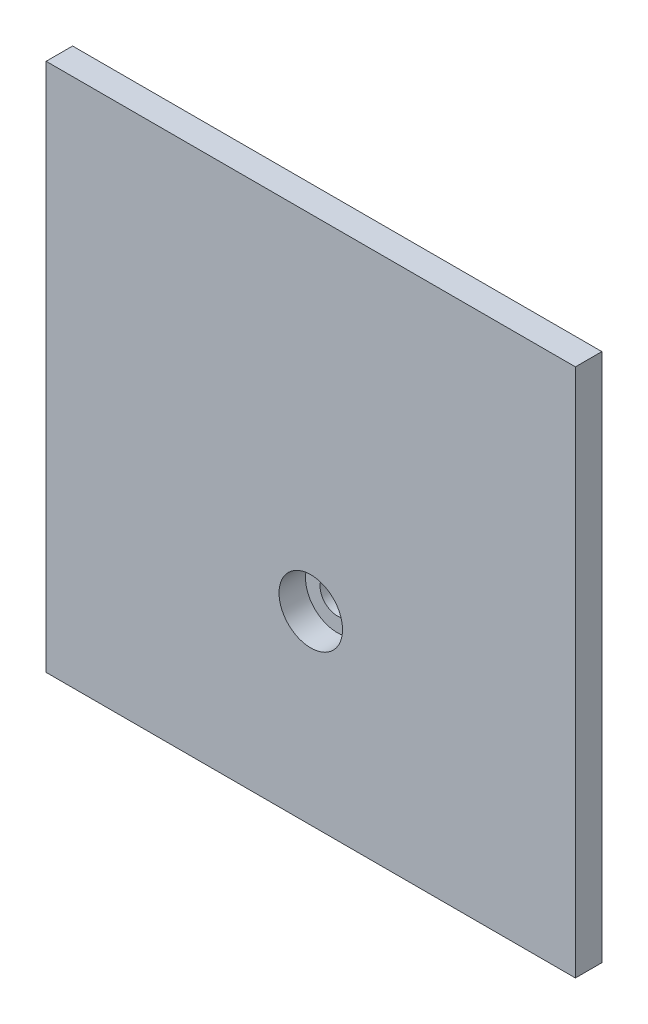
ISO-10303-21;
HEADER;
FILE_DESCRIPTION(('STEP AP214'),'2;1');
FILE_NAME('part.step','',(''),(''),'','','');
FILE_SCHEMA(('AUTOMOTIVE_DESIGN { 1 0 10303 214 1 1 1 1 }'));
ENDSEC;
DATA;
#1=APPLICATION_CONTEXT('core data for automotive mechanical design processes');
#2=APPLICATION_PROTOCOL_DEFINITION('international standard','automotive_design',2000,#1);
#3=PRODUCT_CONTEXT('',#1,'mechanical');
#4=PRODUCT('Part','Part','',(#3));
#5=PRODUCT_RELATED_PRODUCT_CATEGORY('part','',(#4));
#6=PRODUCT_DEFINITION_FORMATION('','',#4);
#7=PRODUCT_DEFINITION_CONTEXT('part definition',#1,'design');
#8=PRODUCT_DEFINITION('design','',#6,#7);
#9=PRODUCT_DEFINITION_SHAPE('','',#8);
#10=(LENGTH_UNIT() NAMED_UNIT(*) SI_UNIT(.MILLI.,.METRE.));
#11=(NAMED_UNIT(*) PLANE_ANGLE_UNIT() SI_UNIT($,.RADIAN.));
#12=(NAMED_UNIT(*) SI_UNIT($,.STERADIAN.) SOLID_ANGLE_UNIT());
#13=UNCERTAINTY_MEASURE_WITH_UNIT(LENGTH_MEASURE(1.E-05),#10,'distance_accuracy_value','');
#14=(GEOMETRIC_REPRESENTATION_CONTEXT(3) GLOBAL_UNCERTAINTY_ASSIGNED_CONTEXT((#13)) GLOBAL_UNIT_ASSIGNED_CONTEXT((#10,
#11,#12)) REPRESENTATION_CONTEXT('',''));
#15=CARTESIAN_POINT('',(0.,0.,0.));
#16=DIRECTION('',(0.,0.,1.));
#17=DIRECTION('',(1.,0.,0.));
#18=AXIS2_PLACEMENT_3D('',#15,#16,#17);
#19=CARTESIAN_POINT('',(0.,-15.,5.));
#20=DIRECTION('',(0.,0.,-1.));
#21=DIRECTION('',(-1.,0.,0.));
#22=AXIS2_PLACEMENT_3D('',#19,#20,#21);
#23=CYLINDRICAL_SURFACE('',#22,3.25);
#24=CARTESIAN_POINT('',(0.,-15.,-30.));
#25=DIRECTION('',(0.,0.,-1.));
#26=DIRECTION('',(-1.,0.,0.));
#27=AXIS2_PLACEMENT_3D('',#24,#25,#26);
#28=CIRCLE('',#27,3.25);
#29=CARTESIAN_POINT('',(-3.25,-15.,-30.));
#30=VERTEX_POINT('',#29);
#31=EDGE_CURVE('E280',#30,#30,#28,.T.);
#32=ORIENTED_EDGE('',*,*,#31,.T.);
#33=EDGE_LOOP('',(#32));
#34=FACE_BOUND('',#33,.T.);
#35=CARTESIAN_POINT('',(0.,-15.,0.));
#36=DIRECTION('',(0.,0.,1.));
#37=DIRECTION('',(1.,0.,0.));
#38=AXIS2_PLACEMENT_3D('',#35,#36,#37);
#39=CIRCLE('',#38,3.25);
#40=CARTESIAN_POINT('',(3.25,-15.,0.));
#41=VERTEX_POINT('',#40);
#42=EDGE_CURVE('E36',#41,#41,#39,.F.);
#43=ORIENTED_EDGE('',*,*,#42,.F.);
#44=EDGE_LOOP('',(#43));
#45=FACE_BOUND('',#44,.T.);
#46=ADVANCED_FACE('F32',(#34,#45),#23,.F.);
#47=CARTESIAN_POINT('',(50.,50.,5.));
#48=DIRECTION('',(-1.,0.,0.));
#49=DIRECTION('',(0.,-1.,0.));
#50=AXIS2_PLACEMENT_3D('',#47,#48,#49);
#51=PLANE('',#50);
#52=DIRECTION('',(0.,1.,0.));
#53=VECTOR('',#52,1.);
#54=CARTESIAN_POINT('',(50.,50.,0.));
#55=LINE('',#54,#53);
#56=CARTESIAN_POINT('',(50.,-50.,0.));
#57=VERTEX_POINT('',#56);
#58=CARTESIAN_POINT('',(50.,50.,0.));
#59=VERTEX_POINT('',#58);
#60=EDGE_CURVE('E126',#57,#59,#55,.T.);
#61=ORIENTED_EDGE('',*,*,#60,.T.);
#62=DIRECTION('',(0.,0.,-1.));
#63=VECTOR('',#62,1.);
#64=CARTESIAN_POINT('',(50.,50.,5.));
#65=LINE('',#64,#63);
#66=CARTESIAN_POINT('',(50.,50.,5.));
#67=VERTEX_POINT('',#66);
#68=EDGE_CURVE('E11',#67,#59,#65,.T.);
#69=ORIENTED_EDGE('',*,*,#68,.F.);
#70=DIRECTION('',(0.,1.,0.));
#71=VECTOR('',#70,1.);
#72=CARTESIAN_POINT('',(50.,50.,5.));
#73=LINE('',#72,#71);
#74=CARTESIAN_POINT('',(50.,-50.,5.));
#75=VERTEX_POINT('',#74);
#76=EDGE_CURVE('E127',#75,#67,#73,.T.);
#77=ORIENTED_EDGE('',*,*,#76,.F.);
#78=DIRECTION('',(0.,0.,-1.));
#79=VECTOR('',#78,1.);
#80=CARTESIAN_POINT('',(50.,-50.,5.));
#81=LINE('',#80,#79);
#82=EDGE_CURVE('E137',#75,#57,#81,.T.);
#83=ORIENTED_EDGE('',*,*,#82,.T.);
#84=EDGE_LOOP('',(#61,#69,#77,#83));
#85=FACE_BOUND('',#84,.T.);
#86=ADVANCED_FACE('F34',(#85),#51,.F.);
#87=CARTESIAN_POINT('',(-50.,50.,5.));
#88=DIRECTION('',(0.,-1.,0.));
#89=DIRECTION('',(0.,0.,-1.));
#90=AXIS2_PLACEMENT_3D('',#87,#88,#89);
#91=PLANE('',#90);
#92=DIRECTION('',(-1.,0.,0.));
#93=VECTOR('',#92,1.);
#94=CARTESIAN_POINT('',(-50.,50.,0.));
#95=LINE('',#94,#93);
#96=CARTESIAN_POINT('',(-50.,50.,0.));
#97=VERTEX_POINT('',#96);
#98=EDGE_CURVE('E140',#59,#97,#95,.T.);
#99=ORIENTED_EDGE('',*,*,#98,.T.);
#100=DIRECTION('',(0.,0.,-1.));
#101=VECTOR('',#100,1.);
#102=CARTESIAN_POINT('',(-50.,50.,5.));
#103=LINE('',#102,#101);
#104=CARTESIAN_POINT('',(-50.,50.,5.));
#105=VERTEX_POINT('',#104);
#106=EDGE_CURVE('E41',#105,#97,#103,.T.);
#107=ORIENTED_EDGE('',*,*,#106,.F.);
#108=DIRECTION('',(-1.,0.,0.));
#109=VECTOR('',#108,1.);
#110=CARTESIAN_POINT('',(-50.,50.,5.));
#111=LINE('',#110,#109);
#112=EDGE_CURVE('E130',#67,#105,#111,.T.);
#113=ORIENTED_EDGE('',*,*,#112,.F.);
#114=ORIENTED_EDGE('',*,*,#68,.T.);
#115=EDGE_LOOP('',(#99,#107,#113,#114));
#116=FACE_BOUND('',#115,.T.);
#117=ADVANCED_FACE('F169',(#116),#91,.F.);
#118=CARTESIAN_POINT('',(-50.,50.,5.));
#119=DIRECTION('',(1.,0.,0.));
#120=DIRECTION('',(0.,1.,0.));
#121=AXIS2_PLACEMENT_3D('',#118,#119,#120);
#122=PLANE('',#121);
#123=DIRECTION('',(0.,-1.,0.));
#124=VECTOR('',#123,1.);
#125=CARTESIAN_POINT('',(-50.,50.,0.));
#126=LINE('',#125,#124);
#127=CARTESIAN_POINT('',(-50.,-50.,0.));
#128=VERTEX_POINT('',#127);
#129=EDGE_CURVE('E142',#97,#128,#126,.T.);
#130=ORIENTED_EDGE('',*,*,#129,.T.);
#131=DIRECTION('',(0.,0.,-1.));
#132=VECTOR('',#131,1.);
#133=CARTESIAN_POINT('',(-50.,-50.,5.));
#134=LINE('',#133,#132);
#135=CARTESIAN_POINT('',(-50.,-50.,5.));
#136=VERTEX_POINT('',#135);
#137=EDGE_CURVE('E147',#136,#128,#134,.T.);
#138=ORIENTED_EDGE('',*,*,#137,.F.);
#139=DIRECTION('',(0.,-1.,0.));
#140=VECTOR('',#139,1.);
#141=CARTESIAN_POINT('',(-50.,50.,5.));
#142=LINE('',#141,#140);
#143=EDGE_CURVE('E133',#105,#136,#142,.T.);
#144=ORIENTED_EDGE('',*,*,#143,.F.);
#145=ORIENTED_EDGE('',*,*,#106,.T.);
#146=EDGE_LOOP('',(#130,#138,#144,#145));
#147=FACE_BOUND('',#146,.T.);
#148=ADVANCED_FACE('F155',(#147),#122,.F.);
#149=CARTESIAN_POINT('',(-50.,-50.,5.));
#150=DIRECTION('',(0.,1.,0.));
#151=DIRECTION('',(0.,0.,1.));
#152=AXIS2_PLACEMENT_3D('',#149,#150,#151);
#153=PLANE('',#152);
#154=DIRECTION('',(1.,0.,0.));
#155=VECTOR('',#154,1.);
#156=CARTESIAN_POINT('',(-50.,-50.,0.));
#157=LINE('',#156,#155);
#158=EDGE_CURVE('E131',#128,#57,#157,.T.);
#159=ORIENTED_EDGE('',*,*,#158,.T.);
#160=ORIENTED_EDGE('',*,*,#82,.F.);
#161=DIRECTION('',(1.,0.,0.));
#162=VECTOR('',#161,1.);
#163=CARTESIAN_POINT('',(-50.,-50.,5.));
#164=LINE('',#163,#162);
#165=EDGE_CURVE('E135',#136,#75,#164,.T.);
#166=ORIENTED_EDGE('',*,*,#165,.F.);
#167=ORIENTED_EDGE('',*,*,#137,.T.);
#168=EDGE_LOOP('',(#159,#160,#166,#167));
#169=FACE_BOUND('',#168,.T.);
#170=ADVANCED_FACE('F162',(#169),#153,.F.);
#171=CARTESIAN_POINT('',(0.,0.,5.));
#172=DIRECTION('',(0.,0.,1.));
#173=DIRECTION('',(1.,0.,0.));
#174=AXIS2_PLACEMENT_3D('',#171,#172,#173);
#175=PLANE('',#174);
#176=CARTESIAN_POINT('',(0.,-15.,5.));
#177=DIRECTION('',(0.,0.,1.));
#178=DIRECTION('',(1.,0.,0.));
#179=AXIS2_PLACEMENT_3D('',#176,#177,#178);
#180=CIRCLE('',#179,6.);
#181=CARTESIAN_POINT('',(6.,-15.,5.));
#182=VERTEX_POINT('',#181);
#183=EDGE_CURVE('E276',#182,#182,#180,.T.);
#184=ORIENTED_EDGE('',*,*,#183,.F.);
#185=EDGE_LOOP('',(#184));
#186=FACE_BOUND('',#185,.T.);
#187=ORIENTED_EDGE('',*,*,#76,.T.);
#188=ORIENTED_EDGE('',*,*,#112,.T.);
#189=ORIENTED_EDGE('',*,*,#143,.T.);
#190=ORIENTED_EDGE('',*,*,#165,.T.);
#191=EDGE_LOOP('',(#187,#188,#189,#190));
#192=FACE_BOUND('',#191,.T.);
#193=ADVANCED_FACE('F168',(#186,#192),#175,.T.);
#194=CARTESIAN_POINT('',(0.,0.,0.));
#195=DIRECTION('',(0.,0.,1.));
#196=DIRECTION('',(1.,0.,0.));
#197=AXIS2_PLACEMENT_3D('',#194,#195,#196);
#198=PLANE('',#197);
#199=DIRECTION('',(0.,-1.,0.));
#200=VECTOR('',#199,1.);
#201=CARTESIAN_POINT('',(15.,-15.,0.));
#202=LINE('',#201,#200);
#203=CARTESIAN_POINT('',(15.,45.,0.));
#204=VERTEX_POINT('',#203);
#205=CARTESIAN_POINT('',(15.,-15.,0.));
#206=VERTEX_POINT('',#205);
#207=EDGE_CURVE('E111',#204,#206,#202,.T.);
#208=ORIENTED_EDGE('',*,*,#207,.F.);
#209=DIRECTION('',(1.,0.,0.));
#210=VECTOR('',#209,1.);
#211=CARTESIAN_POINT('',(15.,45.,0.));
#212=LINE('',#211,#210);
#213=CARTESIAN_POINT('',(-15.,45.,0.));
#214=VERTEX_POINT('',#213);
#215=EDGE_CURVE('E100',#214,#204,#212,.T.);
#216=ORIENTED_EDGE('',*,*,#215,.F.);
#217=DIRECTION('',(0.,1.,0.));
#218=VECTOR('',#217,1.);
#219=CARTESIAN_POINT('',(-15.,45.,0.));
#220=LINE('',#219,#218);
#221=CARTESIAN_POINT('',(-15.,-15.,0.));
#222=VERTEX_POINT('',#221);
#223=EDGE_CURVE('E109',#222,#214,#220,.T.);
#224=ORIENTED_EDGE('',*,*,#223,.F.);
#225=CARTESIAN_POINT('',(0.,-15.,0.));
#226=DIRECTION('',(0.,0.,-1.));
#227=DIRECTION('',(-1.,0.,0.));
#228=AXIS2_PLACEMENT_3D('',#225,#226,#227);
#229=CIRCLE('',#228,15.);
#230=EDGE_CURVE('E56',#206,#222,#229,.T.);
#231=ORIENTED_EDGE('',*,*,#230,.F.);
#232=EDGE_LOOP('',(#208,#216,#224,#231));
#233=FACE_BOUND('',#232,.T.);
#234=ORIENTED_EDGE('',*,*,#60,.F.);
#235=ORIENTED_EDGE('',*,*,#158,.F.);
#236=ORIENTED_EDGE('',*,*,#129,.F.);
#237=ORIENTED_EDGE('',*,*,#98,.F.);
#238=EDGE_LOOP('',(#234,#235,#236,#237));
#239=FACE_BOUND('',#238,.T.);
#240=ADVANCED_FACE('F107',(#233,#239),#198,.F.);
#241=CARTESIAN_POINT('',(15.,-15.,-30.));
#242=DIRECTION('',(-1.,0.,0.));
#243=DIRECTION('',(0.,0.,1.));
#244=AXIS2_PLACEMENT_3D('',#241,#242,#243);
#245=PLANE('',#244);
#246=DIRECTION('',(0.,-1.,0.));
#247=VECTOR('',#246,1.);
#248=CARTESIAN_POINT('',(15.,-15.,-30.));
#249=LINE('',#248,#247);
#250=CARTESIAN_POINT('',(15.,0.,-30.));
#251=VERTEX_POINT('',#250);
#252=CARTESIAN_POINT('',(15.,-15.,-30.));
#253=VERTEX_POINT('',#252);
#254=EDGE_CURVE('E112',#251,#253,#249,.T.);
#255=ORIENTED_EDGE('',*,*,#254,.F.);
#256=DIRECTION('',(0.,-0.832050294337844,-0.554700196225229));
#257=VECTOR('',#256,1.);
#258=CARTESIAN_POINT('',(15.,45.,0.));
#259=LINE('',#258,#257);
#260=EDGE_CURVE('E48',#204,#251,#259,.T.);
#261=ORIENTED_EDGE('',*,*,#260,.F.);
#262=ORIENTED_EDGE('',*,*,#207,.T.);
#263=DIRECTION('',(0.,0.,1.));
#264=VECTOR('',#263,1.);
#265=CARTESIAN_POINT('',(15.,-15.,-30.));
#266=LINE('',#265,#264);
#267=EDGE_CURVE('E123',#253,#206,#266,.T.);
#268=ORIENTED_EDGE('',*,*,#267,.F.);
#269=EDGE_LOOP('',(#255,#261,#262,#268));
#270=FACE_BOUND('',#269,.T.);
#271=ADVANCED_FACE('F200',(#270),#245,.F.);
#272=CARTESIAN_POINT('',(0.,-15.,-30.));
#273=DIRECTION('',(0.,0.,1.));
#274=DIRECTION('',(1.,0.,0.));
#275=AXIS2_PLACEMENT_3D('',#272,#273,#274);
#276=CYLINDRICAL_SURFACE('',#275,15.);
#277=ORIENTED_EDGE('',*,*,#230,.T.);
#278=DIRECTION('',(0.,0.,1.));
#279=VECTOR('',#278,1.);
#280=CARTESIAN_POINT('',(-15.,-15.,-30.));
#281=LINE('',#280,#279);
#282=CARTESIAN_POINT('',(-15.,-15.,-30.));
#283=VERTEX_POINT('',#282);
#284=EDGE_CURVE('E117',#283,#222,#281,.T.);
#285=ORIENTED_EDGE('',*,*,#284,.F.);
#286=CARTESIAN_POINT('',(0.,-15.,-30.));
#287=DIRECTION('',(0.,0.,-1.));
#288=DIRECTION('',(-1.,0.,0.));
#289=AXIS2_PLACEMENT_3D('',#286,#287,#288);
#290=CIRCLE('',#289,15.);
#291=EDGE_CURVE('E285',#253,#283,#290,.T.);
#292=ORIENTED_EDGE('',*,*,#291,.F.);
#293=ORIENTED_EDGE('',*,*,#267,.T.);
#294=EDGE_LOOP('',(#277,#285,#292,#293));
#295=FACE_BOUND('',#294,.T.);
#296=ADVANCED_FACE('F197',(#295),#276,.T.);
#297=CARTESIAN_POINT('',(-15.,45.,-30.));
#298=DIRECTION('',(1.,0.,0.));
#299=DIRECTION('',(0.,1.,0.));
#300=AXIS2_PLACEMENT_3D('',#297,#298,#299);
#301=PLANE('',#300);
#302=ORIENTED_EDGE('',*,*,#223,.T.);
#303=DIRECTION('',(0.,-0.832050294337844,-0.554700196225229));
#304=VECTOR('',#303,1.);
#305=CARTESIAN_POINT('',(-15.,45.,0.));
#306=LINE('',#305,#304);
#307=CARTESIAN_POINT('',(-15.,0.,-30.));
#308=VERTEX_POINT('',#307);
#309=EDGE_CURVE('E97',#214,#308,#306,.T.);
#310=ORIENTED_EDGE('',*,*,#309,.T.);
#311=DIRECTION('',(0.,1.,0.));
#312=VECTOR('',#311,1.);
#313=CARTESIAN_POINT('',(-15.,45.,-30.));
#314=LINE('',#313,#312);
#315=EDGE_CURVE('E124',#283,#308,#314,.T.);
#316=ORIENTED_EDGE('',*,*,#315,.F.);
#317=ORIENTED_EDGE('',*,*,#284,.T.);
#318=EDGE_LOOP('',(#302,#310,#316,#317));
#319=FACE_BOUND('',#318,.T.);
#320=ADVANCED_FACE('F115',(#319),#301,.F.);
#321=CARTESIAN_POINT('',(0.,-15.,-30.));
#322=DIRECTION('',(0.,0.,-1.));
#323=DIRECTION('',(-1.,0.,0.));
#324=AXIS2_PLACEMENT_3D('',#321,#322,#323);
#325=PLANE('',#324);
#326=ORIENTED_EDGE('',*,*,#31,.F.);
#327=EDGE_LOOP('',(#326));
#328=FACE_BOUND('',#327,.T.);
#329=DIRECTION('',(1.,0.,0.));
#330=VECTOR('',#329,1.);
#331=CARTESIAN_POINT('',(-15.,0.,-30.));
#332=LINE('',#331,#330);
#333=EDGE_CURVE('E101',#308,#251,#332,.T.);
#334=ORIENTED_EDGE('',*,*,#333,.T.);
#335=ORIENTED_EDGE('',*,*,#254,.T.);
#336=ORIENTED_EDGE('',*,*,#291,.T.);
#337=ORIENTED_EDGE('',*,*,#315,.T.);
#338=EDGE_LOOP('',(#334,#335,#336,#337));
#339=FACE_BOUND('',#338,.T.);
#340=ADVANCED_FACE('F191',(#328,#339),#325,.T.);
#341=CARTESIAN_POINT('',(-15.,45.,0.));
#342=DIRECTION('',(0.,-0.554700196225229,0.832050294337844));
#343=DIRECTION('',(0.,-0.832050294337844,-0.554700196225229));
#344=AXIS2_PLACEMENT_3D('',#341,#342,#343);
#345=PLANE('',#344);
#346=ORIENTED_EDGE('',*,*,#260,.T.);
#347=ORIENTED_EDGE('',*,*,#333,.F.);
#348=ORIENTED_EDGE('',*,*,#309,.F.);
#349=ORIENTED_EDGE('',*,*,#215,.T.);
#350=EDGE_LOOP('',(#346,#347,#348,#349));
#351=FACE_BOUND('',#350,.T.);
#352=ADVANCED_FACE('F99',(#351),#345,.F.);
#353=CARTESIAN_POINT('',(0.,-15.,0.));
#354=DIRECTION('',(0.,0.,1.));
#355=DIRECTION('',(1.,0.,0.));
#356=AXIS2_PLACEMENT_3D('',#353,#354,#355);
#357=PLANE('',#356);
#358=CARTESIAN_POINT('',(0.,-15.,0.));
#359=DIRECTION('',(0.,0.,1.));
#360=DIRECTION('',(1.,0.,0.));
#361=AXIS2_PLACEMENT_3D('',#358,#359,#360);
#362=CIRCLE('',#361,6.);
#363=CARTESIAN_POINT('',(6.,-15.,0.));
#364=VERTEX_POINT('',#363);
#365=EDGE_CURVE('E273',#364,#364,#362,.T.);
#366=ORIENTED_EDGE('',*,*,#365,.T.);
#367=EDGE_LOOP('',(#366));
#368=FACE_BOUND('',#367,.T.);
#369=ORIENTED_EDGE('',*,*,#42,.T.);
#370=EDGE_LOOP('',(#369));
#371=FACE_BOUND('',#370,.T.);
#372=ADVANCED_FACE('F190',(#368,#371),#357,.T.);
#373=CARTESIAN_POINT('',(0.,-15.,0.));
#374=DIRECTION('',(0.,0.,1.));
#375=DIRECTION('',(1.,0.,0.));
#376=AXIS2_PLACEMENT_3D('',#373,#374,#375);
#377=CYLINDRICAL_SURFACE('',#376,6.);
#378=ORIENTED_EDGE('',*,*,#365,.F.);
#379=EDGE_LOOP('',(#378));
#380=FACE_BOUND('',#379,.T.);
#381=ORIENTED_EDGE('',*,*,#183,.T.);
#382=EDGE_LOOP('',(#381));
#383=FACE_BOUND('',#382,.T.);
#384=ADVANCED_FACE('F187',(#380,#383),#377,.F.);
#385=CLOSED_SHELL('',(#46,#86,#117,#148,#170,#193,#240,#271,#296,#320,#340,#352,#372,#384));
#386=MANIFOLD_SOLID_BREP('B2',#385);
#387=ADVANCED_BREP_SHAPE_REPRESENTATION('',(#18,#386),#14);
#388=SHAPE_DEFINITION_REPRESENTATION(#9,#387);
ENDSEC;
END-ISO-10303-21;
